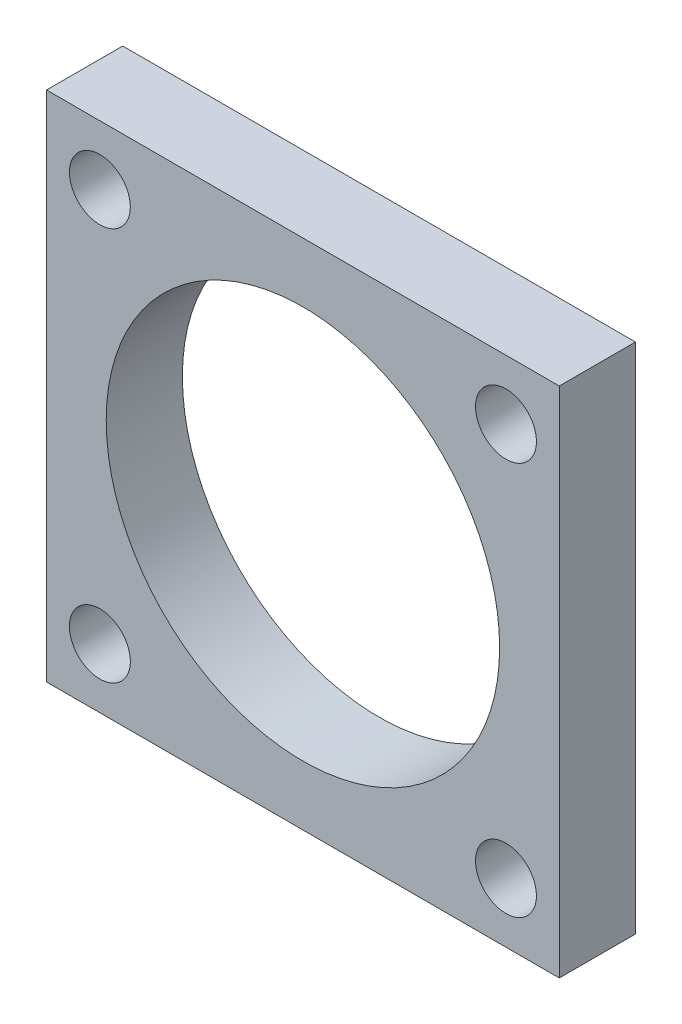
ISO-10303-21;
HEADER;
FILE_DESCRIPTION(('STEP AP214'),'2;1');
FILE_NAME('part.step','',(''),(''),'','','');
FILE_SCHEMA(('AUTOMOTIVE_DESIGN { 1 0 10303 214 1 1 1 1 }'));
ENDSEC;
DATA;
#1=APPLICATION_CONTEXT('core data for automotive mechanical design processes');
#2=APPLICATION_PROTOCOL_DEFINITION('international standard','automotive_design',2000,#1);
#3=PRODUCT_CONTEXT('',#1,'mechanical');
#4=PRODUCT('Part','Part','',(#3));
#5=PRODUCT_RELATED_PRODUCT_CATEGORY('part','',(#4));
#6=PRODUCT_DEFINITION_FORMATION('','',#4);
#7=PRODUCT_DEFINITION_CONTEXT('part definition',#1,'design');
#8=PRODUCT_DEFINITION('design','',#6,#7);
#9=PRODUCT_DEFINITION_SHAPE('','',#8);
#10=(LENGTH_UNIT() NAMED_UNIT(*) SI_UNIT(.MILLI.,.METRE.));
#11=(NAMED_UNIT(*) PLANE_ANGLE_UNIT() SI_UNIT($,.RADIAN.));
#12=(NAMED_UNIT(*) SI_UNIT($,.STERADIAN.) SOLID_ANGLE_UNIT());
#13=UNCERTAINTY_MEASURE_WITH_UNIT(LENGTH_MEASURE(1.E-05),#10,'distance_accuracy_value','');
#14=(GEOMETRIC_REPRESENTATION_CONTEXT(3) GLOBAL_UNCERTAINTY_ASSIGNED_CONTEXT((#13)) GLOBAL_UNIT_ASSIGNED_CONTEXT((#10,
#11,#12)) REPRESENTATION_CONTEXT('',''));
#15=CARTESIAN_POINT('',(0.,0.,0.));
#16=DIRECTION('',(0.,0.,1.));
#17=DIRECTION('',(1.,0.,0.));
#18=AXIS2_PLACEMENT_3D('',#15,#16,#17);
#19=CARTESIAN_POINT('',(0.,0.,3.));
#20=DIRECTION('',(0.,0.,-1.));
#21=DIRECTION('',(-1.,0.,0.));
#22=AXIS2_PLACEMENT_3D('',#19,#20,#21);
#23=PLANE('',#22);
#24=DIRECTION('',(0.,-1.,0.));
#25=VECTOR('',#24,1.);
#26=CARTESIAN_POINT('',(-11.644211534369,-10.6330708661417,3.));
#27=LINE('',#26,#25);
#28=CARTESIAN_POINT('',(-11.644211534369,9.56692913385826,3.));
#29=VERTEX_POINT('',#28);
#30=CARTESIAN_POINT('',(-11.644211534369,-10.6330708661417,3.));
#31=VERTEX_POINT('',#30);
#32=EDGE_CURVE('E92',#29,#31,#27,.T.);
#33=ORIENTED_EDGE('',*,*,#32,.T.);
#34=DIRECTION('',(1.,0.,0.));
#35=VECTOR('',#34,1.);
#36=CARTESIAN_POINT('',(8.55578846563099,-10.6330708661417,3.));
#37=LINE('',#36,#35);
#38=CARTESIAN_POINT('',(8.55578846563099,-10.6330708661417,3.));
#39=VERTEX_POINT('',#38);
#40=EDGE_CURVE('E87',#31,#39,#37,.T.);
#41=ORIENTED_EDGE('',*,*,#40,.T.);
#42=DIRECTION('',(0.,1.,0.));
#43=VECTOR('',#42,1.);
#44=CARTESIAN_POINT('',(8.55578846563099,9.56692913385826,3.));
#45=LINE('',#44,#43);
#46=CARTESIAN_POINT('',(8.55578846563099,9.56692913385826,3.));
#47=VERTEX_POINT('',#46);
#48=EDGE_CURVE('E90',#39,#47,#45,.T.);
#49=ORIENTED_EDGE('',*,*,#48,.T.);
#50=DIRECTION('',(-1.,0.,0.));
#51=VECTOR('',#50,1.);
#52=CARTESIAN_POINT('',(-11.644211534369,9.56692913385826,3.));
#53=LINE('',#52,#51);
#54=EDGE_CURVE('E57',#47,#29,#53,.T.);
#55=ORIENTED_EDGE('',*,*,#54,.T.);
#56=EDGE_LOOP('',(#33,#41,#49,#55));
#57=FACE_BOUND('',#56,.T.);
#58=CARTESIAN_POINT('',(-1.54421153436901,-0.533070866141736,3.));
#59=DIRECTION('',(0.,0.,1.));
#60=DIRECTION('',(1.,0.,0.));
#61=AXIS2_PLACEMENT_3D('',#58,#59,#60);
#62=CIRCLE('',#61,7.75);
#63=CARTESIAN_POINT('',(6.20578846563099,-0.533070866141736,3.));
#64=VERTEX_POINT('',#63);
#65=EDGE_CURVE('E112',#64,#64,#62,.T.);
#66=ORIENTED_EDGE('',*,*,#65,.F.);
#67=EDGE_LOOP('',(#66));
#68=FACE_BOUND('',#67,.T.);
#69=CARTESIAN_POINT('',(-9.54421153436901,7.21692913385827,3.));
#70=DIRECTION('',(0.,0.,1.));
#71=DIRECTION('',(1.,0.,0.));
#72=AXIS2_PLACEMENT_3D('',#69,#70,#71);
#73=CIRCLE('',#72,1.2);
#74=CARTESIAN_POINT('',(-8.34421153436901,7.21692913385827,3.));
#75=VERTEX_POINT('',#74);
#76=EDGE_CURVE('E134',#75,#75,#73,.T.);
#77=ORIENTED_EDGE('',*,*,#76,.F.);
#78=EDGE_LOOP('',(#77));
#79=FACE_BOUND('',#78,.T.);
#80=CARTESIAN_POINT('',(6.45578846563099,7.21692913385827,3.));
#81=DIRECTION('',(0.,0.,1.));
#82=DIRECTION('',(-1.,0.,0.));
#83=AXIS2_PLACEMENT_3D('',#80,#81,#82);
#84=CIRCLE('',#83,1.2);
#85=CARTESIAN_POINT('',(5.25578846563099,7.21692913385827,3.));
#86=VERTEX_POINT('',#85);
#87=EDGE_CURVE('E142',#86,#86,#84,.T.);
#88=ORIENTED_EDGE('',*,*,#87,.F.);
#89=EDGE_LOOP('',(#88));
#90=FACE_BOUND('',#89,.T.);
#91=CARTESIAN_POINT('',(-9.54421153436901,-8.28307086614174,3.));
#92=DIRECTION('',(0.,0.,1.));
#93=DIRECTION('',(-1.,0.,0.));
#94=AXIS2_PLACEMENT_3D('',#91,#92,#93);
#95=CIRCLE('',#94,1.2);
#96=CARTESIAN_POINT('',(-10.744211534369,-8.28307086614174,3.));
#97=VERTEX_POINT('',#96);
#98=EDGE_CURVE('E150',#97,#97,#95,.T.);
#99=ORIENTED_EDGE('',*,*,#98,.F.);
#100=EDGE_LOOP('',(#99));
#101=FACE_BOUND('',#100,.T.);
#102=CARTESIAN_POINT('',(6.45578846563099,-8.28307086614174,3.));
#103=DIRECTION('',(0.,0.,1.));
#104=DIRECTION('',(1.,0.,0.));
#105=AXIS2_PLACEMENT_3D('',#102,#103,#104);
#106=CIRCLE('',#105,1.2);
#107=CARTESIAN_POINT('',(7.65578846563099,-8.28307086614174,3.));
#108=VERTEX_POINT('',#107);
#109=EDGE_CURVE('E158',#108,#108,#106,.T.);
#110=ORIENTED_EDGE('',*,*,#109,.F.);
#111=EDGE_LOOP('',(#110));
#112=FACE_BOUND('',#111,.T.);
#113=ADVANCED_FACE('F39',(#57,#68,#79,#90,#101,#112),#23,.F.);
#114=CARTESIAN_POINT('',(0.,0.,0.));
#115=DIRECTION('',(0.,0.,-1.));
#116=DIRECTION('',(-1.,0.,0.));
#117=AXIS2_PLACEMENT_3D('',#114,#115,#116);
#118=PLANE('',#117);
#119=CARTESIAN_POINT('',(-9.54421153436901,-8.28307086614174,0.));
#120=DIRECTION('',(0.,0.,1.));
#121=DIRECTION('',(-1.,0.,0.));
#122=AXIS2_PLACEMENT_3D('',#119,#120,#121);
#123=CIRCLE('',#122,1.2);
#124=CARTESIAN_POINT('',(-10.744211534369,-8.28307086614174,0.));
#125=VERTEX_POINT('',#124);
#126=EDGE_CURVE('E154',#125,#125,#123,.T.);
#127=ORIENTED_EDGE('',*,*,#126,.T.);
#128=EDGE_LOOP('',(#127));
#129=FACE_BOUND('',#128,.T.);
#130=CARTESIAN_POINT('',(-9.54421153436901,7.21692913385827,0.));
#131=DIRECTION('',(0.,0.,1.));
#132=DIRECTION('',(1.,0.,0.));
#133=AXIS2_PLACEMENT_3D('',#130,#131,#132);
#134=CIRCLE('',#133,1.2);
#135=CARTESIAN_POINT('',(-8.34421153436901,7.21692913385827,0.));
#136=VERTEX_POINT('',#135);
#137=EDGE_CURVE('E138',#136,#136,#134,.T.);
#138=ORIENTED_EDGE('',*,*,#137,.T.);
#139=EDGE_LOOP('',(#138));
#140=FACE_BOUND('',#139,.T.);
#141=DIRECTION('',(0.,-1.,0.));
#142=VECTOR('',#141,1.);
#143=CARTESIAN_POINT('',(-11.644211534369,-10.6330708661417,0.));
#144=LINE('',#143,#142);
#145=CARTESIAN_POINT('',(-11.644211534369,9.56692913385826,0.));
#146=VERTEX_POINT('',#145);
#147=CARTESIAN_POINT('',(-11.644211534369,-10.6330708661417,0.));
#148=VERTEX_POINT('',#147);
#149=EDGE_CURVE('E108',#146,#148,#144,.T.);
#150=ORIENTED_EDGE('',*,*,#149,.F.);
#151=DIRECTION('',(-1.,0.,0.));
#152=VECTOR('',#151,1.);
#153=CARTESIAN_POINT('',(-11.644211534369,9.56692913385826,0.));
#154=LINE('',#153,#152);
#155=CARTESIAN_POINT('',(8.55578846563099,9.56692913385826,0.));
#156=VERTEX_POINT('',#155);
#157=EDGE_CURVE('E80',#156,#146,#154,.T.);
#158=ORIENTED_EDGE('',*,*,#157,.F.);
#159=DIRECTION('',(0.,1.,0.));
#160=VECTOR('',#159,1.);
#161=CARTESIAN_POINT('',(8.55578846563099,9.56692913385826,0.));
#162=LINE('',#161,#160);
#163=CARTESIAN_POINT('',(8.55578846563099,-10.6330708661417,0.));
#164=VERTEX_POINT('',#163);
#165=EDGE_CURVE('E74',#164,#156,#162,.T.);
#166=ORIENTED_EDGE('',*,*,#165,.F.);
#167=DIRECTION('',(1.,0.,0.));
#168=VECTOR('',#167,1.);
#169=CARTESIAN_POINT('',(8.55578846563099,-10.6330708661417,0.));
#170=LINE('',#169,#168);
#171=EDGE_CURVE('E97',#148,#164,#170,.T.);
#172=ORIENTED_EDGE('',*,*,#171,.F.);
#173=EDGE_LOOP('',(#150,#158,#166,#172));
#174=FACE_BOUND('',#173,.T.);
#175=CARTESIAN_POINT('',(-1.54421153436901,-0.533070866141736,0.));
#176=DIRECTION('',(0.,0.,1.));
#177=DIRECTION('',(1.,0.,0.));
#178=AXIS2_PLACEMENT_3D('',#175,#176,#177);
#179=CIRCLE('',#178,7.75);
#180=CARTESIAN_POINT('',(6.20578846563099,-0.533070866141736,0.));
#181=VERTEX_POINT('',#180);
#182=EDGE_CURVE('E130',#181,#181,#179,.T.);
#183=ORIENTED_EDGE('',*,*,#182,.T.);
#184=EDGE_LOOP('',(#183));
#185=FACE_BOUND('',#184,.T.);
#186=CARTESIAN_POINT('',(6.45578846563099,7.21692913385827,0.));
#187=DIRECTION('',(0.,0.,1.));
#188=DIRECTION('',(-1.,0.,0.));
#189=AXIS2_PLACEMENT_3D('',#186,#187,#188);
#190=CIRCLE('',#189,1.2);
#191=CARTESIAN_POINT('',(5.25578846563099,7.21692913385827,0.));
#192=VERTEX_POINT('',#191);
#193=EDGE_CURVE('E146',#192,#192,#190,.T.);
#194=ORIENTED_EDGE('',*,*,#193,.T.);
#195=EDGE_LOOP('',(#194));
#196=FACE_BOUND('',#195,.T.);
#197=CARTESIAN_POINT('',(6.45578846563099,-8.28307086614174,0.));
#198=DIRECTION('',(0.,0.,1.));
#199=DIRECTION('',(1.,0.,0.));
#200=AXIS2_PLACEMENT_3D('',#197,#198,#199);
#201=CIRCLE('',#200,1.2);
#202=CARTESIAN_POINT('',(7.65578846563099,-8.28307086614174,0.));
#203=VERTEX_POINT('',#202);
#204=EDGE_CURVE('E162',#203,#203,#201,.T.);
#205=ORIENTED_EDGE('',*,*,#204,.T.);
#206=EDGE_LOOP('',(#205));
#207=FACE_BOUND('',#206,.T.);
#208=ADVANCED_FACE('F125',(#129,#140,#174,#185,#196,#207),#118,.T.);
#209=CARTESIAN_POINT('',(-11.644211534369,-10.6330708661417,3.));
#210=DIRECTION('',(1.,0.,0.));
#211=DIRECTION('',(0.,0.,-1.));
#212=AXIS2_PLACEMENT_3D('',#209,#210,#211);
#213=PLANE('',#212);
#214=ORIENTED_EDGE('',*,*,#149,.T.);
#215=DIRECTION('',(0.,0.,-1.));
#216=VECTOR('',#215,1.);
#217=CARTESIAN_POINT('',(-11.644211534369,-10.6330708661417,3.));
#218=LINE('',#217,#216);
#219=EDGE_CURVE('E11',#31,#148,#218,.T.);
#220=ORIENTED_EDGE('',*,*,#219,.F.);
#221=ORIENTED_EDGE('',*,*,#32,.F.);
#222=DIRECTION('',(0.,0.,-1.));
#223=VECTOR('',#222,1.);
#224=CARTESIAN_POINT('',(-11.644211534369,9.56692913385826,3.));
#225=LINE('',#224,#223);
#226=EDGE_CURVE('E104',#29,#146,#225,.T.);
#227=ORIENTED_EDGE('',*,*,#226,.T.);
#228=EDGE_LOOP('',(#214,#220,#221,#227));
#229=FACE_BOUND('',#228,.T.);
#230=ADVANCED_FACE('F41',(#229),#213,.F.);
#231=CARTESIAN_POINT('',(8.55578846563099,-10.6330708661417,3.));
#232=DIRECTION('',(0.,1.,0.));
#233=DIRECTION('',(0.,0.,1.));
#234=AXIS2_PLACEMENT_3D('',#231,#232,#233);
#235=PLANE('',#234);
#236=ORIENTED_EDGE('',*,*,#171,.T.);
#237=DIRECTION('',(0.,0.,-1.));
#238=VECTOR('',#237,1.);
#239=CARTESIAN_POINT('',(8.55578846563099,-10.6330708661417,3.));
#240=LINE('',#239,#238);
#241=EDGE_CURVE('E49',#39,#164,#240,.T.);
#242=ORIENTED_EDGE('',*,*,#241,.F.);
#243=ORIENTED_EDGE('',*,*,#40,.F.);
#244=ORIENTED_EDGE('',*,*,#219,.T.);
#245=EDGE_LOOP('',(#236,#242,#243,#244));
#246=FACE_BOUND('',#245,.T.);
#247=ADVANCED_FACE('F96',(#246),#235,.F.);
#248=CARTESIAN_POINT('',(8.55578846563099,9.56692913385826,3.));
#249=DIRECTION('',(-1.,0.,0.));
#250=DIRECTION('',(0.,-1.,0.));
#251=AXIS2_PLACEMENT_3D('',#248,#249,#250);
#252=PLANE('',#251);
#253=ORIENTED_EDGE('',*,*,#165,.T.);
#254=DIRECTION('',(0.,0.,-1.));
#255=VECTOR('',#254,1.);
#256=CARTESIAN_POINT('',(8.55578846563099,9.56692913385826,3.));
#257=LINE('',#256,#255);
#258=EDGE_CURVE('E99',#47,#156,#257,.T.);
#259=ORIENTED_EDGE('',*,*,#258,.F.);
#260=ORIENTED_EDGE('',*,*,#48,.F.);
#261=ORIENTED_EDGE('',*,*,#241,.T.);
#262=EDGE_LOOP('',(#253,#259,#260,#261));
#263=FACE_BOUND('',#262,.T.);
#264=ADVANCED_FACE('F100',(#263),#252,.F.);
#265=CARTESIAN_POINT('',(-11.644211534369,9.56692913385826,3.));
#266=DIRECTION('',(0.,-1.,0.));
#267=DIRECTION('',(0.,0.,-1.));
#268=AXIS2_PLACEMENT_3D('',#265,#266,#267);
#269=PLANE('',#268);
#270=ORIENTED_EDGE('',*,*,#157,.T.);
#271=ORIENTED_EDGE('',*,*,#226,.F.);
#272=ORIENTED_EDGE('',*,*,#54,.F.);
#273=ORIENTED_EDGE('',*,*,#258,.T.);
#274=EDGE_LOOP('',(#270,#271,#272,#273));
#275=FACE_BOUND('',#274,.T.);
#276=ADVANCED_FACE('F122',(#275),#269,.F.);
#277=CARTESIAN_POINT('',(-1.54421153436901,-0.533070866141736,3.));
#278=DIRECTION('',(0.,0.,-1.));
#279=DIRECTION('',(-1.,0.,0.));
#280=AXIS2_PLACEMENT_3D('',#277,#278,#279);
#281=CYLINDRICAL_SURFACE('',#280,7.75);
#282=ORIENTED_EDGE('',*,*,#65,.T.);
#283=EDGE_LOOP('',(#282));
#284=FACE_BOUND('',#283,.T.);
#285=ORIENTED_EDGE('',*,*,#182,.F.);
#286=EDGE_LOOP('',(#285));
#287=FACE_BOUND('',#286,.T.);
#288=ADVANCED_FACE('F181',(#284,#287),#281,.F.);
#289=CARTESIAN_POINT('',(-9.54421153436901,7.21692913385827,3.));
#290=DIRECTION('',(0.,0.,-1.));
#291=DIRECTION('',(-1.,0.,0.));
#292=AXIS2_PLACEMENT_3D('',#289,#290,#291);
#293=CYLINDRICAL_SURFACE('',#292,1.2);
#294=ORIENTED_EDGE('',*,*,#76,.T.);
#295=EDGE_LOOP('',(#294));
#296=FACE_BOUND('',#295,.T.);
#297=ORIENTED_EDGE('',*,*,#137,.F.);
#298=EDGE_LOOP('',(#297));
#299=FACE_BOUND('',#298,.T.);
#300=ADVANCED_FACE('F227',(#296,#299),#293,.F.);
#301=CARTESIAN_POINT('',(6.45578846563099,7.21692913385827,3.));
#302=DIRECTION('',(0.,0.,-1.));
#303=DIRECTION('',(-1.,0.,0.));
#304=AXIS2_PLACEMENT_3D('',#301,#302,#303);
#305=CYLINDRICAL_SURFACE('',#304,1.2);
#306=ORIENTED_EDGE('',*,*,#87,.T.);
#307=EDGE_LOOP('',(#306));
#308=FACE_BOUND('',#307,.T.);
#309=ORIENTED_EDGE('',*,*,#193,.F.);
#310=EDGE_LOOP('',(#309));
#311=FACE_BOUND('',#310,.T.);
#312=ADVANCED_FACE('F235',(#308,#311),#305,.F.);
#313=CARTESIAN_POINT('',(-9.54421153436901,-8.28307086614174,3.));
#314=DIRECTION('',(0.,0.,-1.));
#315=DIRECTION('',(-1.,0.,0.));
#316=AXIS2_PLACEMENT_3D('',#313,#314,#315);
#317=CYLINDRICAL_SURFACE('',#316,1.2);
#318=ORIENTED_EDGE('',*,*,#98,.T.);
#319=EDGE_LOOP('',(#318));
#320=FACE_BOUND('',#319,.T.);
#321=ORIENTED_EDGE('',*,*,#126,.F.);
#322=EDGE_LOOP('',(#321));
#323=FACE_BOUND('',#322,.T.);
#324=ADVANCED_FACE('F243',(#320,#323),#317,.F.);
#325=CARTESIAN_POINT('',(6.45578846563099,-8.28307086614174,3.));
#326=DIRECTION('',(0.,0.,-1.));
#327=DIRECTION('',(-1.,0.,0.));
#328=AXIS2_PLACEMENT_3D('',#325,#326,#327);
#329=CYLINDRICAL_SURFACE('',#328,1.2);
#330=ORIENTED_EDGE('',*,*,#109,.T.);
#331=EDGE_LOOP('',(#330));
#332=FACE_BOUND('',#331,.T.);
#333=ORIENTED_EDGE('',*,*,#204,.F.);
#334=EDGE_LOOP('',(#333));
#335=FACE_BOUND('',#334,.T.);
#336=ADVANCED_FACE('F170',(#332,#335),#329,.F.);
#337=CLOSED_SHELL('',(#113,#208,#230,#247,#264,#276,#288,#300,#312,#324,#336));
#338=MANIFOLD_SOLID_BREP('B2',#337);
#339=ADVANCED_BREP_SHAPE_REPRESENTATION('',(#18,#338),#14);
#340=SHAPE_DEFINITION_REPRESENTATION(#9,#339);
ENDSEC;
END-ISO-10303-21;
